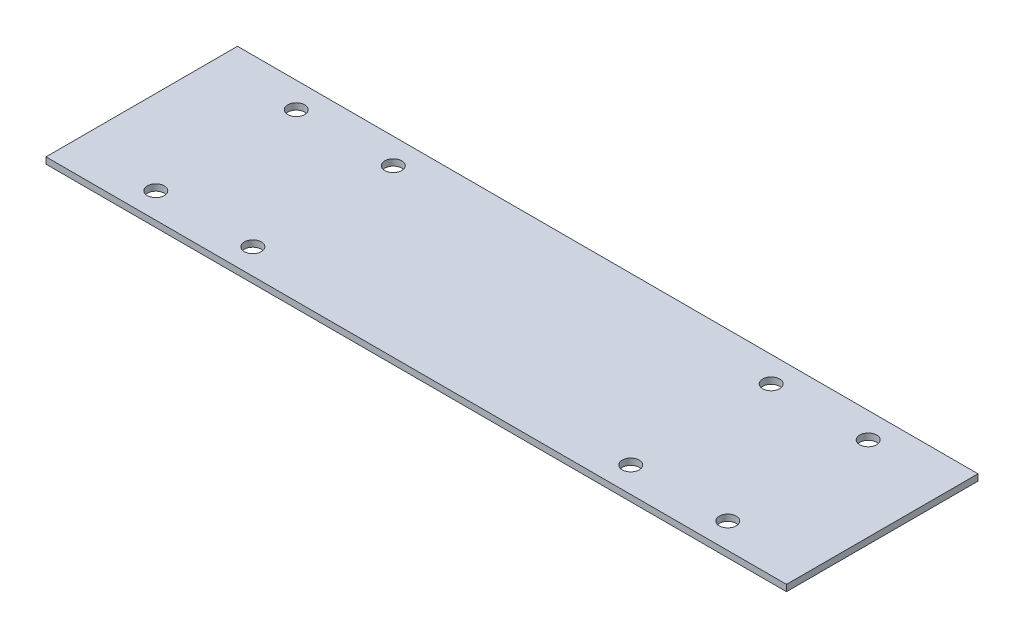
ISO-10303-21;
HEADER;
FILE_DESCRIPTION(('STEP AP214'),'2;1');
FILE_NAME('part.step','',(''),(''),'','','');
FILE_SCHEMA(('AUTOMOTIVE_DESIGN { 1 0 10303 214 1 1 1 1 }'));
ENDSEC;
DATA;
#1=APPLICATION_CONTEXT('core data for automotive mechanical design processes');
#2=APPLICATION_PROTOCOL_DEFINITION('international standard','automotive_design',2000,#1);
#3=PRODUCT_CONTEXT('',#1,'mechanical');
#4=PRODUCT('Part','Part','',(#3));
#5=PRODUCT_RELATED_PRODUCT_CATEGORY('part','',(#4));
#6=PRODUCT_DEFINITION_FORMATION('','',#4);
#7=PRODUCT_DEFINITION_CONTEXT('part definition',#1,'design');
#8=PRODUCT_DEFINITION('design','',#6,#7);
#9=PRODUCT_DEFINITION_SHAPE('','',#8);
#10=(LENGTH_UNIT() NAMED_UNIT(*) SI_UNIT(.MILLI.,.METRE.));
#11=(NAMED_UNIT(*) PLANE_ANGLE_UNIT() SI_UNIT($,.RADIAN.));
#12=(NAMED_UNIT(*) SI_UNIT($,.STERADIAN.) SOLID_ANGLE_UNIT());
#13=UNCERTAINTY_MEASURE_WITH_UNIT(LENGTH_MEASURE(1.E-05),#10,'distance_accuracy_value','');
#14=(GEOMETRIC_REPRESENTATION_CONTEXT(3) GLOBAL_UNCERTAINTY_ASSIGNED_CONTEXT((#13)) GLOBAL_UNIT_ASSIGNED_CONTEXT((#10,
#11,#12)) REPRESENTATION_CONTEXT('',''));
#15=CARTESIAN_POINT('',(0.,0.,0.));
#16=DIRECTION('',(0.,0.,1.));
#17=DIRECTION('',(1.,0.,0.));
#18=AXIS2_PLACEMENT_3D('',#15,#16,#17);
#19=CARTESIAN_POINT('',(0.,1.25,0.));
#20=DIRECTION('',(0.,1.,0.));
#21=DIRECTION('',(0.,0.,1.));
#22=AXIS2_PLACEMENT_3D('',#19,#20,#21);
#23=PLANE('',#22);
#24=CARTESIAN_POINT('',(37.9414824447334,1.25,-25.0747724317295));
#25=DIRECTION('',(0.,1.,0.));
#26=DIRECTION('',(0.,0.,1.));
#27=AXIS2_PLACEMENT_3D('',#24,#25,#26);
#28=CIRCLE('',#27,1.66);
#29=CARTESIAN_POINT('',(37.9414824447334,1.25,-23.4147724317295));
#30=VERTEX_POINT('',#29);
#31=EDGE_CURVE('E145',#30,#30,#28,.T.);
#32=ORIENTED_EDGE('',*,*,#31,.F.);
#33=EDGE_LOOP('',(#32));
#34=FACE_BOUND('',#33,.T.);
#35=CARTESIAN_POINT('',(56.9414824447334,1.25,-25.0747724317295));
#36=DIRECTION('',(0.,1.,0.));
#37=DIRECTION('',(0.,0.,1.));
#38=AXIS2_PLACEMENT_3D('',#35,#36,#37);
#39=CIRCLE('',#38,1.66);
#40=CARTESIAN_POINT('',(56.9414824447334,1.25,-23.4147724317295));
#41=VERTEX_POINT('',#40);
#42=EDGE_CURVE('E133',#41,#41,#39,.T.);
#43=ORIENTED_EDGE('',*,*,#42,.F.);
#44=EDGE_LOOP('',(#43));
#45=FACE_BOUND('',#44,.T.);
#46=CARTESIAN_POINT('',(-55.0585175552666,1.25,2.42522756827048));
#47=DIRECTION('',(0.,1.,0.));
#48=DIRECTION('',(0.,0.,1.));
#49=AXIS2_PLACEMENT_3D('',#46,#47,#48);
#50=CIRCLE('',#49,1.66);
#51=CARTESIAN_POINT('',(-55.0585175552666,1.25,4.08522756827048));
#52=VERTEX_POINT('',#51);
#53=EDGE_CURVE('E121',#52,#52,#50,.T.);
#54=ORIENTED_EDGE('',*,*,#53,.F.);
#55=EDGE_LOOP('',(#54));
#56=FACE_BOUND('',#55,.T.);
#57=CARTESIAN_POINT('',(-55.0585175552666,1.25,-25.0747724317295));
#58=DIRECTION('',(0.,1.,0.));
#59=DIRECTION('',(0.,0.,1.));
#60=AXIS2_PLACEMENT_3D('',#57,#58,#59);
#61=CIRCLE('',#60,1.66);
#62=CARTESIAN_POINT('',(-55.0585175552666,1.25,-23.4147724317295));
#63=VERTEX_POINT('',#62);
#64=EDGE_CURVE('E100',#63,#63,#61,.T.);
#65=ORIENTED_EDGE('',*,*,#64,.F.);
#66=EDGE_LOOP('',(#65));
#67=FACE_BOUND('',#66,.T.);
#68=DIRECTION('',(0.,0.,1.));
#69=VECTOR('',#68,1.);
#70=CARTESIAN_POINT('',(-71.5585175552666,1.25,-30.0747724317295));
#71=LINE('',#70,#69);
#72=CARTESIAN_POINT('',(-71.5585175552666,1.25,-30.0747724317295));
#73=VERTEX_POINT('',#72);
#74=CARTESIAN_POINT('',(-71.5585175552666,1.25,7.42522756827048));
#75=VERTEX_POINT('',#74);
#76=EDGE_CURVE('E85',#73,#75,#71,.T.);
#77=ORIENTED_EDGE('',*,*,#76,.T.);
#78=DIRECTION('',(1.,0.,0.));
#79=VECTOR('',#78,1.);
#80=CARTESIAN_POINT('',(-71.5585175552666,1.25,7.42522756827048));
#81=LINE('',#80,#79);
#82=CARTESIAN_POINT('',(73.4414824447334,1.25,7.42522756827048));
#83=VERTEX_POINT('',#82);
#84=EDGE_CURVE('E80',#75,#83,#81,.T.);
#85=ORIENTED_EDGE('',*,*,#84,.T.);
#86=DIRECTION('',(0.,0.,-1.));
#87=VECTOR('',#86,1.);
#88=CARTESIAN_POINT('',(73.4414824447334,1.25,-30.0747724317295));
#89=LINE('',#88,#87);
#90=CARTESIAN_POINT('',(73.4414824447334,1.25,-30.0747724317295));
#91=VERTEX_POINT('',#90);
#92=EDGE_CURVE('E83',#83,#91,#89,.T.);
#93=ORIENTED_EDGE('',*,*,#92,.T.);
#94=DIRECTION('',(-1.,0.,0.));
#95=VECTOR('',#94,1.);
#96=CARTESIAN_POINT('',(-71.5585175552666,1.25,-30.0747724317295));
#97=LINE('',#96,#95);
#98=EDGE_CURVE('E50',#91,#73,#97,.T.);
#99=ORIENTED_EDGE('',*,*,#98,.T.);
#100=EDGE_LOOP('',(#77,#85,#93,#99));
#101=FACE_BOUND('',#100,.T.);
#102=CARTESIAN_POINT('',(-36.0585175552666,1.25,-25.0747724317295));
#103=DIRECTION('',(0.,1.,0.));
#104=DIRECTION('',(0.,0.,1.));
#105=AXIS2_PLACEMENT_3D('',#102,#103,#104);
#106=CIRCLE('',#105,1.66);
#107=CARTESIAN_POINT('',(-36.0585175552666,1.25,-23.4147724317295));
#108=VERTEX_POINT('',#107);
#109=EDGE_CURVE('E115',#108,#108,#106,.T.);
#110=ORIENTED_EDGE('',*,*,#109,.F.);
#111=EDGE_LOOP('',(#110));
#112=FACE_BOUND('',#111,.T.);
#113=CARTESIAN_POINT('',(-36.0585175552666,1.25,2.42522756827048));
#114=DIRECTION('',(0.,1.,0.));
#115=DIRECTION('',(0.,0.,1.));
#116=AXIS2_PLACEMENT_3D('',#113,#114,#115);
#117=CIRCLE('',#116,1.66);
#118=CARTESIAN_POINT('',(-36.0585175552666,1.25,4.08522756827048));
#119=VERTEX_POINT('',#118);
#120=EDGE_CURVE('E127',#119,#119,#117,.T.);
#121=ORIENTED_EDGE('',*,*,#120,.F.);
#122=EDGE_LOOP('',(#121));
#123=FACE_BOUND('',#122,.T.);
#124=CARTESIAN_POINT('',(37.9414824447334,1.25,2.42522756827048));
#125=DIRECTION('',(0.,1.,0.));
#126=DIRECTION('',(0.,0.,1.));
#127=AXIS2_PLACEMENT_3D('',#124,#125,#126);
#128=CIRCLE('',#127,1.66);
#129=CARTESIAN_POINT('',(37.9414824447334,1.25,4.08522756827048));
#130=VERTEX_POINT('',#129);
#131=EDGE_CURVE('E139',#130,#130,#128,.T.);
#132=ORIENTED_EDGE('',*,*,#131,.F.);
#133=EDGE_LOOP('',(#132));
#134=FACE_BOUND('',#133,.T.);
#135=CARTESIAN_POINT('',(56.9414824447334,1.25,2.42522756827048));
#136=DIRECTION('',(0.,1.,0.));
#137=DIRECTION('',(0.,0.,1.));
#138=AXIS2_PLACEMENT_3D('',#135,#136,#137);
#139=CIRCLE('',#138,1.66);
#140=CARTESIAN_POINT('',(56.9414824447334,1.25,4.08522756827048));
#141=VERTEX_POINT('',#140);
#142=EDGE_CURVE('E151',#141,#141,#139,.T.);
#143=ORIENTED_EDGE('',*,*,#142,.F.);
#144=EDGE_LOOP('',(#143));
#145=FACE_BOUND('',#144,.T.);
#146=ADVANCED_FACE('F33',(#34,#45,#56,#67,#101,#112,#123,#134,#145),#23,.T.);
#147=CARTESIAN_POINT('',(0.,0.,0.));
#148=DIRECTION('',(0.,1.,0.));
#149=DIRECTION('',(0.,0.,1.));
#150=AXIS2_PLACEMENT_3D('',#147,#148,#149);
#151=PLANE('',#150);
#152=DIRECTION('',(0.,0.,1.));
#153=VECTOR('',#152,1.);
#154=CARTESIAN_POINT('',(-71.5585175552666,0.,-30.0747724317295));
#155=LINE('',#154,#153);
#156=CARTESIAN_POINT('',(-71.5585175552666,0.,-30.0747724317295));
#157=VERTEX_POINT('',#156);
#158=CARTESIAN_POINT('',(-71.5585175552666,0.,7.42522756827048));
#159=VERTEX_POINT('',#158);
#160=EDGE_CURVE('E97',#157,#159,#155,.T.);
#161=ORIENTED_EDGE('',*,*,#160,.F.);
#162=DIRECTION('',(-1.,0.,0.));
#163=VECTOR('',#162,1.);
#164=CARTESIAN_POINT('',(-71.5585175552666,0.,-30.0747724317295));
#165=LINE('',#164,#163);
#166=CARTESIAN_POINT('',(73.4414824447334,0.,-30.0747724317295));
#167=VERTEX_POINT('',#166);
#168=EDGE_CURVE('E73',#167,#157,#165,.T.);
#169=ORIENTED_EDGE('',*,*,#168,.F.);
#170=DIRECTION('',(0.,0.,-1.));
#171=VECTOR('',#170,1.);
#172=CARTESIAN_POINT('',(73.4414824447334,0.,-30.0747724317295));
#173=LINE('',#172,#171);
#174=CARTESIAN_POINT('',(73.4414824447334,0.,7.42522756827048));
#175=VERTEX_POINT('',#174);
#176=EDGE_CURVE('E67',#175,#167,#173,.T.);
#177=ORIENTED_EDGE('',*,*,#176,.F.);
#178=DIRECTION('',(1.,0.,0.));
#179=VECTOR('',#178,1.);
#180=CARTESIAN_POINT('',(-71.5585175552666,0.,7.42522756827048));
#181=LINE('',#180,#179);
#182=EDGE_CURVE('E89',#159,#175,#181,.T.);
#183=ORIENTED_EDGE('',*,*,#182,.F.);
#184=EDGE_LOOP('',(#161,#169,#177,#183));
#185=FACE_BOUND('',#184,.T.);
#186=CARTESIAN_POINT('',(-55.0585175552666,0.,-25.0747724317295));
#187=DIRECTION('',(0.,1.,0.));
#188=DIRECTION('',(0.,0.,1.));
#189=AXIS2_PLACEMENT_3D('',#186,#187,#188);
#190=CIRCLE('',#189,1.66);
#191=CARTESIAN_POINT('',(-55.0585175552666,0.,-23.4147724317295));
#192=VERTEX_POINT('',#191);
#193=EDGE_CURVE('E112',#192,#192,#190,.T.);
#194=ORIENTED_EDGE('',*,*,#193,.T.);
#195=EDGE_LOOP('',(#194));
#196=FACE_BOUND('',#195,.T.);
#197=CARTESIAN_POINT('',(-36.0585175552666,0.,-25.0747724317295));
#198=DIRECTION('',(0.,1.,0.));
#199=DIRECTION('',(0.,0.,1.));
#200=AXIS2_PLACEMENT_3D('',#197,#198,#199);
#201=CIRCLE('',#200,1.66);
#202=CARTESIAN_POINT('',(-36.0585175552666,0.,-23.4147724317295));
#203=VERTEX_POINT('',#202);
#204=EDGE_CURVE('E118',#203,#203,#201,.T.);
#205=ORIENTED_EDGE('',*,*,#204,.T.);
#206=EDGE_LOOP('',(#205));
#207=FACE_BOUND('',#206,.T.);
#208=CARTESIAN_POINT('',(-55.0585175552666,0.,2.42522756827048));
#209=DIRECTION('',(0.,1.,0.));
#210=DIRECTION('',(0.,0.,1.));
#211=AXIS2_PLACEMENT_3D('',#208,#209,#210);
#212=CIRCLE('',#211,1.66);
#213=CARTESIAN_POINT('',(-55.0585175552666,0.,4.08522756827048));
#214=VERTEX_POINT('',#213);
#215=EDGE_CURVE('E124',#214,#214,#212,.T.);
#216=ORIENTED_EDGE('',*,*,#215,.T.);
#217=EDGE_LOOP('',(#216));
#218=FACE_BOUND('',#217,.T.);
#219=CARTESIAN_POINT('',(-36.0585175552666,0.,2.42522756827048));
#220=DIRECTION('',(0.,1.,0.));
#221=DIRECTION('',(0.,0.,1.));
#222=AXIS2_PLACEMENT_3D('',#219,#220,#221);
#223=CIRCLE('',#222,1.66);
#224=CARTESIAN_POINT('',(-36.0585175552666,0.,4.08522756827048));
#225=VERTEX_POINT('',#224);
#226=EDGE_CURVE('E130',#225,#225,#223,.T.);
#227=ORIENTED_EDGE('',*,*,#226,.T.);
#228=EDGE_LOOP('',(#227));
#229=FACE_BOUND('',#228,.T.);
#230=CARTESIAN_POINT('',(56.9414824447334,0.,-25.0747724317295));
#231=DIRECTION('',(0.,1.,0.));
#232=DIRECTION('',(0.,0.,1.));
#233=AXIS2_PLACEMENT_3D('',#230,#231,#232);
#234=CIRCLE('',#233,1.66);
#235=CARTESIAN_POINT('',(56.9414824447334,0.,-23.4147724317295));
#236=VERTEX_POINT('',#235);
#237=EDGE_CURVE('E136',#236,#236,#234,.T.);
#238=ORIENTED_EDGE('',*,*,#237,.T.);
#239=EDGE_LOOP('',(#238));
#240=FACE_BOUND('',#239,.T.);
#241=CARTESIAN_POINT('',(37.9414824447334,0.,2.42522756827048));
#242=DIRECTION('',(0.,1.,0.));
#243=DIRECTION('',(0.,0.,1.));
#244=AXIS2_PLACEMENT_3D('',#241,#242,#243);
#245=CIRCLE('',#244,1.66);
#246=CARTESIAN_POINT('',(37.9414824447334,0.,4.08522756827048));
#247=VERTEX_POINT('',#246);
#248=EDGE_CURVE('E142',#247,#247,#245,.T.);
#249=ORIENTED_EDGE('',*,*,#248,.T.);
#250=EDGE_LOOP('',(#249));
#251=FACE_BOUND('',#250,.T.);
#252=CARTESIAN_POINT('',(37.9414824447334,0.,-25.0747724317295));
#253=DIRECTION('',(0.,1.,0.));
#254=DIRECTION('',(0.,0.,1.));
#255=AXIS2_PLACEMENT_3D('',#252,#253,#254);
#256=CIRCLE('',#255,1.66);
#257=CARTESIAN_POINT('',(37.9414824447334,0.,-23.4147724317295));
#258=VERTEX_POINT('',#257);
#259=EDGE_CURVE('E148',#258,#258,#256,.T.);
#260=ORIENTED_EDGE('',*,*,#259,.T.);
#261=EDGE_LOOP('',(#260));
#262=FACE_BOUND('',#261,.T.);
#263=CARTESIAN_POINT('',(56.9414824447334,0.,2.42522756827048));
#264=DIRECTION('',(0.,1.,0.));
#265=DIRECTION('',(0.,0.,1.));
#266=AXIS2_PLACEMENT_3D('',#263,#264,#265);
#267=CIRCLE('',#266,1.66);
#268=CARTESIAN_POINT('',(56.9414824447334,0.,4.08522756827048));
#269=VERTEX_POINT('',#268);
#270=EDGE_CURVE('E154',#269,#269,#267,.T.);
#271=ORIENTED_EDGE('',*,*,#270,.T.);
#272=EDGE_LOOP('',(#271));
#273=FACE_BOUND('',#272,.T.);
#274=ADVANCED_FACE('F108',(#185,#196,#207,#218,#229,#240,#251,#262,#273),#151,.F.);
#275=CARTESIAN_POINT('',(-71.5585175552666,1.25,-30.0747724317295));
#276=DIRECTION('',(1.,0.,0.));
#277=DIRECTION('',(0.,0.,-1.));
#278=AXIS2_PLACEMENT_3D('',#275,#276,#277);
#279=PLANE('',#278);
#280=ORIENTED_EDGE('',*,*,#160,.T.);
#281=DIRECTION('',(0.,-1.,0.));
#282=VECTOR('',#281,1.);
#283=CARTESIAN_POINT('',(-71.5585175552666,1.25,7.42522756827048));
#284=LINE('',#283,#282);
#285=EDGE_CURVE('E11',#75,#159,#284,.T.);
#286=ORIENTED_EDGE('',*,*,#285,.F.);
#287=ORIENTED_EDGE('',*,*,#76,.F.);
#288=DIRECTION('',(0.,-1.,0.));
#289=VECTOR('',#288,1.);
#290=CARTESIAN_POINT('',(-71.5585175552666,1.25,-30.0747724317295));
#291=LINE('',#290,#289);
#292=EDGE_CURVE('E93',#73,#157,#291,.T.);
#293=ORIENTED_EDGE('',*,*,#292,.T.);
#294=EDGE_LOOP('',(#280,#286,#287,#293));
#295=FACE_BOUND('',#294,.T.);
#296=ADVANCED_FACE('F35',(#295),#279,.F.);
#297=CARTESIAN_POINT('',(-71.5585175552666,1.25,7.42522756827048));
#298=DIRECTION('',(0.,0.,-1.));
#299=DIRECTION('',(-1.,0.,0.));
#300=AXIS2_PLACEMENT_3D('',#297,#298,#299);
#301=PLANE('',#300);
#302=ORIENTED_EDGE('',*,*,#182,.T.);
#303=DIRECTION('',(0.,-1.,0.));
#304=VECTOR('',#303,1.);
#305=CARTESIAN_POINT('',(73.4414824447334,1.25,7.42522756827048));
#306=LINE('',#305,#304);
#307=EDGE_CURVE('E42',#83,#175,#306,.T.);
#308=ORIENTED_EDGE('',*,*,#307,.F.);
#309=ORIENTED_EDGE('',*,*,#84,.F.);
#310=ORIENTED_EDGE('',*,*,#285,.T.);
#311=EDGE_LOOP('',(#302,#308,#309,#310));
#312=FACE_BOUND('',#311,.T.);
#313=ADVANCED_FACE('F88',(#312),#301,.F.);
#314=CARTESIAN_POINT('',(73.4414824447334,1.25,-30.0747724317295));
#315=DIRECTION('',(-1.,0.,0.));
#316=DIRECTION('',(0.,0.,1.));
#317=AXIS2_PLACEMENT_3D('',#314,#315,#316);
#318=PLANE('',#317);
#319=ORIENTED_EDGE('',*,*,#176,.T.);
#320=DIRECTION('',(0.,-1.,0.));
#321=VECTOR('',#320,1.);
#322=CARTESIAN_POINT('',(73.4414824447334,1.25,-30.0747724317295));
#323=LINE('',#322,#321);
#324=EDGE_CURVE('E90',#91,#167,#323,.T.);
#325=ORIENTED_EDGE('',*,*,#324,.F.);
#326=ORIENTED_EDGE('',*,*,#92,.F.);
#327=ORIENTED_EDGE('',*,*,#307,.T.);
#328=EDGE_LOOP('',(#319,#325,#326,#327));
#329=FACE_BOUND('',#328,.T.);
#330=ADVANCED_FACE('F91',(#329),#318,.F.);
#331=CARTESIAN_POINT('',(-71.5585175552666,1.25,-30.0747724317295));
#332=DIRECTION('',(0.,0.,1.));
#333=DIRECTION('',(1.,0.,0.));
#334=AXIS2_PLACEMENT_3D('',#331,#332,#333);
#335=PLANE('',#334);
#336=ORIENTED_EDGE('',*,*,#168,.T.);
#337=ORIENTED_EDGE('',*,*,#292,.F.);
#338=ORIENTED_EDGE('',*,*,#98,.F.);
#339=ORIENTED_EDGE('',*,*,#324,.T.);
#340=EDGE_LOOP('',(#336,#337,#338,#339));
#341=FACE_BOUND('',#340,.T.);
#342=ADVANCED_FACE('F105',(#341),#335,.F.);
#343=CARTESIAN_POINT('',(-55.0585175552666,1.25,-25.0747724317295));
#344=DIRECTION('',(0.,-1.,0.));
#345=DIRECTION('',(0.,0.,-1.));
#346=AXIS2_PLACEMENT_3D('',#343,#344,#345);
#347=CYLINDRICAL_SURFACE('',#346,1.66);
#348=ORIENTED_EDGE('',*,*,#64,.T.);
#349=EDGE_LOOP('',(#348));
#350=FACE_BOUND('',#349,.T.);
#351=ORIENTED_EDGE('',*,*,#193,.F.);
#352=EDGE_LOOP('',(#351));
#353=FACE_BOUND('',#352,.T.);
#354=ADVANCED_FACE('F173',(#350,#353),#347,.F.);
#355=CARTESIAN_POINT('',(-36.0585175552666,1.25,-25.0747724317295));
#356=DIRECTION('',(0.,-1.,0.));
#357=DIRECTION('',(0.,0.,-1.));
#358=AXIS2_PLACEMENT_3D('',#355,#356,#357);
#359=CYLINDRICAL_SURFACE('',#358,1.66);
#360=ORIENTED_EDGE('',*,*,#109,.T.);
#361=EDGE_LOOP('',(#360));
#362=FACE_BOUND('',#361,.T.);
#363=ORIENTED_EDGE('',*,*,#204,.F.);
#364=EDGE_LOOP('',(#363));
#365=FACE_BOUND('',#364,.T.);
#366=ADVANCED_FACE('F219',(#362,#365),#359,.F.);
#367=CARTESIAN_POINT('',(-55.0585175552666,1.25,2.42522756827048));
#368=DIRECTION('',(0.,-1.,0.));
#369=DIRECTION('',(0.,0.,-1.));
#370=AXIS2_PLACEMENT_3D('',#367,#368,#369);
#371=CYLINDRICAL_SURFACE('',#370,1.66);
#372=ORIENTED_EDGE('',*,*,#53,.T.);
#373=EDGE_LOOP('',(#372));
#374=FACE_BOUND('',#373,.T.);
#375=ORIENTED_EDGE('',*,*,#215,.F.);
#376=EDGE_LOOP('',(#375));
#377=FACE_BOUND('',#376,.T.);
#378=ADVANCED_FACE('F227',(#374,#377),#371,.F.);
#379=CARTESIAN_POINT('',(-36.0585175552666,1.25,2.42522756827048));
#380=DIRECTION('',(0.,-1.,0.));
#381=DIRECTION('',(0.,0.,-1.));
#382=AXIS2_PLACEMENT_3D('',#379,#380,#381);
#383=CYLINDRICAL_SURFACE('',#382,1.66);
#384=ORIENTED_EDGE('',*,*,#120,.T.);
#385=EDGE_LOOP('',(#384));
#386=FACE_BOUND('',#385,.T.);
#387=ORIENTED_EDGE('',*,*,#226,.F.);
#388=EDGE_LOOP('',(#387));
#389=FACE_BOUND('',#388,.T.);
#390=ADVANCED_FACE('F235',(#386,#389),#383,.F.);
#391=CARTESIAN_POINT('',(56.9414824447334,1.25,-25.0747724317295));
#392=DIRECTION('',(0.,-1.,0.));
#393=DIRECTION('',(0.,0.,-1.));
#394=AXIS2_PLACEMENT_3D('',#391,#392,#393);
#395=CYLINDRICAL_SURFACE('',#394,1.66);
#396=ORIENTED_EDGE('',*,*,#42,.T.);
#397=EDGE_LOOP('',(#396));
#398=FACE_BOUND('',#397,.T.);
#399=ORIENTED_EDGE('',*,*,#237,.F.);
#400=EDGE_LOOP('',(#399));
#401=FACE_BOUND('',#400,.T.);
#402=ADVANCED_FACE('F244',(#398,#401),#395,.F.);
#403=CARTESIAN_POINT('',(37.9414824447334,1.25,2.42522756827048));
#404=DIRECTION('',(0.,-1.,0.));
#405=DIRECTION('',(0.,0.,-1.));
#406=AXIS2_PLACEMENT_3D('',#403,#404,#405);
#407=CYLINDRICAL_SURFACE('',#406,1.66);
#408=ORIENTED_EDGE('',*,*,#131,.T.);
#409=EDGE_LOOP('',(#408));
#410=FACE_BOUND('',#409,.T.);
#411=ORIENTED_EDGE('',*,*,#248,.F.);
#412=EDGE_LOOP('',(#411));
#413=FACE_BOUND('',#412,.T.);
#414=ADVANCED_FACE('F253',(#410,#413),#407,.F.);
#415=CARTESIAN_POINT('',(37.9414824447334,1.25,-25.0747724317295));
#416=DIRECTION('',(0.,-1.,0.));
#417=DIRECTION('',(0.,0.,-1.));
#418=AXIS2_PLACEMENT_3D('',#415,#416,#417);
#419=CYLINDRICAL_SURFACE('',#418,1.66);
#420=ORIENTED_EDGE('',*,*,#31,.T.);
#421=EDGE_LOOP('',(#420));
#422=FACE_BOUND('',#421,.T.);
#423=ORIENTED_EDGE('',*,*,#259,.F.);
#424=EDGE_LOOP('',(#423));
#425=FACE_BOUND('',#424,.T.);
#426=ADVANCED_FACE('F262',(#422,#425),#419,.F.);
#427=CARTESIAN_POINT('',(56.9414824447334,1.25,2.42522756827048));
#428=DIRECTION('',(0.,-1.,0.));
#429=DIRECTION('',(0.,0.,-1.));
#430=AXIS2_PLACEMENT_3D('',#427,#428,#429);
#431=CYLINDRICAL_SURFACE('',#430,1.66);
#432=ORIENTED_EDGE('',*,*,#142,.T.);
#433=EDGE_LOOP('',(#432));
#434=FACE_BOUND('',#433,.T.);
#435=ORIENTED_EDGE('',*,*,#270,.F.);
#436=EDGE_LOOP('',(#435));
#437=FACE_BOUND('',#436,.T.);
#438=ADVANCED_FACE('F160',(#434,#437),#431,.F.);
#439=CLOSED_SHELL('',(#146,#274,#296,#313,#330,#342,#354,#366,#378,#390,#402,#414,#426,#438));
#440=MANIFOLD_SOLID_BREP('B2',#439);
#441=ADVANCED_BREP_SHAPE_REPRESENTATION('',(#18,#440),#14);
#442=SHAPE_DEFINITION_REPRESENTATION(#9,#441);
ENDSEC;
END-ISO-10303-21;
